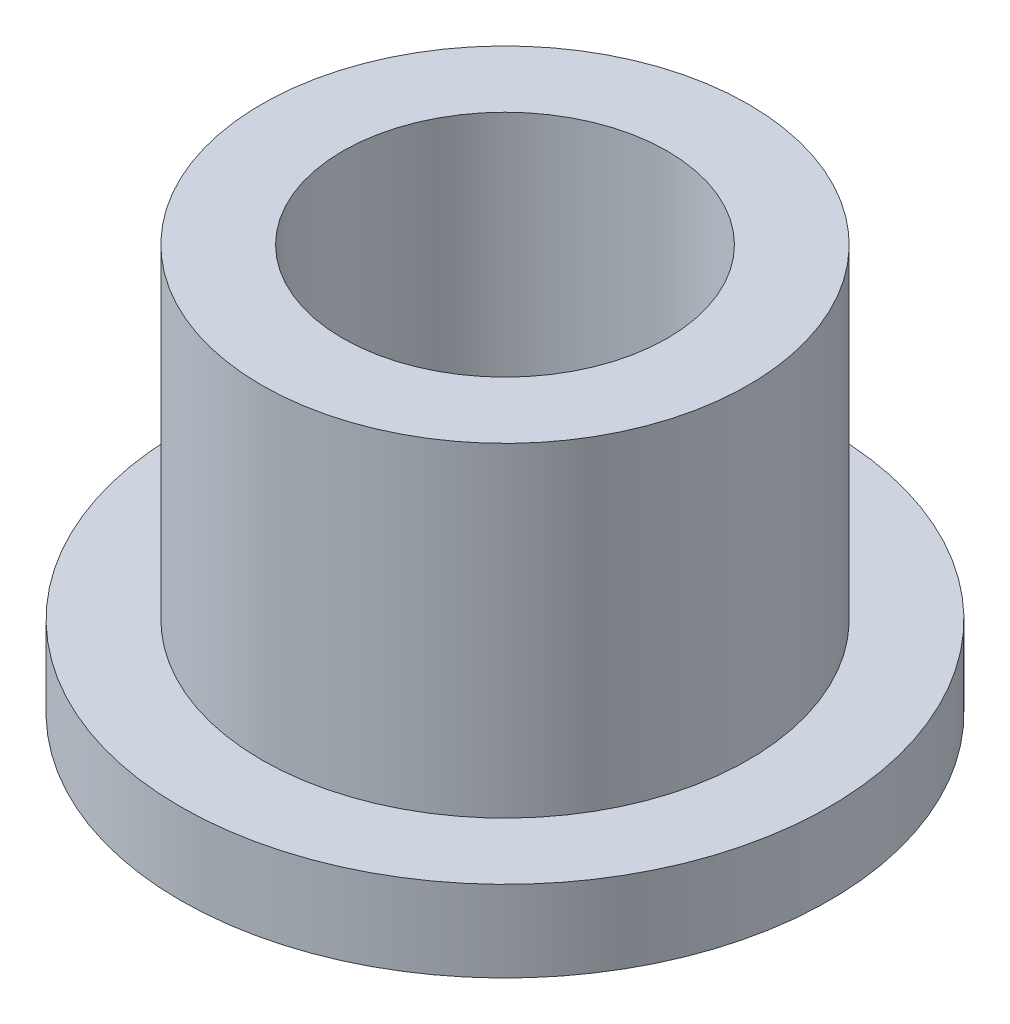
ISO-10303-21;
HEADER;
FILE_DESCRIPTION(('STEP AP214'),'2;1');
FILE_NAME('part.step','',(''),(''),'','','');
FILE_SCHEMA(('AUTOMOTIVE_DESIGN { 1 0 10303 214 1 1 1 1 }'));
ENDSEC;
DATA;
#1=APPLICATION_CONTEXT('core data for automotive mechanical design processes');
#2=APPLICATION_PROTOCOL_DEFINITION('international standard','automotive_design',2000,#1);
#3=PRODUCT_CONTEXT('',#1,'mechanical');
#4=PRODUCT('Part','Part','',(#3));
#5=PRODUCT_RELATED_PRODUCT_CATEGORY('part','',(#4));
#6=PRODUCT_DEFINITION_FORMATION('','',#4);
#7=PRODUCT_DEFINITION_CONTEXT('part definition',#1,'design');
#8=PRODUCT_DEFINITION('design','',#6,#7);
#9=PRODUCT_DEFINITION_SHAPE('','',#8);
#10=(LENGTH_UNIT() NAMED_UNIT(*) SI_UNIT(.MILLI.,.METRE.));
#11=(NAMED_UNIT(*) PLANE_ANGLE_UNIT() SI_UNIT($,.RADIAN.));
#12=(NAMED_UNIT(*) SI_UNIT($,.STERADIAN.) SOLID_ANGLE_UNIT());
#13=UNCERTAINTY_MEASURE_WITH_UNIT(LENGTH_MEASURE(1.E-05),#10,'distance_accuracy_value','');
#14=(GEOMETRIC_REPRESENTATION_CONTEXT(3) GLOBAL_UNCERTAINTY_ASSIGNED_CONTEXT((#13)) GLOBAL_UNIT_ASSIGNED_CONTEXT((#10,
#11,#12)) REPRESENTATION_CONTEXT('',''));
#15=CARTESIAN_POINT('',(0.,0.,0.));
#16=DIRECTION('',(0.,0.,1.));
#17=DIRECTION('',(1.,0.,0.));
#18=AXIS2_PLACEMENT_3D('',#15,#16,#17);
#19=CARTESIAN_POINT('',(0.,7.9375,0.));
#20=DIRECTION('',(0.,1.,0.));
#21=DIRECTION('',(0.,0.,1.));
#22=AXIS2_PLACEMENT_3D('',#19,#20,#21);
#23=PLANE('',#22);
#24=CARTESIAN_POINT('',(0.,7.9375,0.));
#25=DIRECTION('',(0.,1.,0.));
#26=DIRECTION('',(0.,0.,1.));
#27=AXIS2_PLACEMENT_3D('',#24,#25,#26);
#28=CIRCLE('',#27,4.7625);
#29=CARTESIAN_POINT('',(0.,7.9375,4.7625));
#30=VERTEX_POINT('',#29);
#31=EDGE_CURVE('E10',#30,#30,#28,.T.);
#32=ORIENTED_EDGE('',*,*,#31,.T.);
#33=EDGE_LOOP('',(#32));
#34=FACE_BOUND('',#33,.T.);
#35=CARTESIAN_POINT('',(0.,7.9375,0.));
#36=DIRECTION('',(0.,1.,0.));
#37=DIRECTION('',(0.,0.,1.));
#38=AXIS2_PLACEMENT_3D('',#35,#36,#37);
#39=CIRCLE('',#38,3.175);
#40=CARTESIAN_POINT('',(0.,7.9375,3.175));
#41=VERTEX_POINT('',#40);
#42=EDGE_CURVE('E39',#41,#41,#39,.T.);
#43=ORIENTED_EDGE('',*,*,#42,.F.);
#44=EDGE_LOOP('',(#43));
#45=FACE_BOUND('',#44,.T.);
#46=ADVANCED_FACE('F32',(#34,#45),#23,.T.);
#47=CARTESIAN_POINT('',(0.,0.,0.));
#48=DIRECTION('',(0.,1.,0.));
#49=DIRECTION('',(0.,0.,1.));
#50=AXIS2_PLACEMENT_3D('',#47,#48,#49);
#51=PLANE('',#50);
#52=CARTESIAN_POINT('',(0.,0.,0.));
#53=DIRECTION('',(0.,1.,0.));
#54=DIRECTION('',(0.,0.,1.));
#55=AXIS2_PLACEMENT_3D('',#52,#53,#54);
#56=CIRCLE('',#55,3.175);
#57=CARTESIAN_POINT('',(0.,0.,3.175));
#58=VERTEX_POINT('',#57);
#59=EDGE_CURVE('E43',#58,#58,#56,.T.);
#60=ORIENTED_EDGE('',*,*,#59,.T.);
#61=EDGE_LOOP('',(#60));
#62=FACE_BOUND('',#61,.T.);
#63=CARTESIAN_POINT('',(0.,0.,0.));
#64=DIRECTION('',(0.,1.,0.));
#65=DIRECTION('',(0.,0.,1.));
#66=AXIS2_PLACEMENT_3D('',#63,#64,#65);
#67=CIRCLE('',#66,6.35);
#68=CARTESIAN_POINT('',(0.,0.,6.35));
#69=VERTEX_POINT('',#68);
#70=EDGE_CURVE('E50',#69,#69,#67,.T.);
#71=ORIENTED_EDGE('',*,*,#70,.F.);
#72=EDGE_LOOP('',(#71));
#73=FACE_BOUND('',#72,.T.);
#74=ADVANCED_FACE('F75',(#62,#73),#51,.F.);
#75=CARTESIAN_POINT('',(0.,7.9375,0.));
#76=DIRECTION('',(0.,-1.,0.));
#77=DIRECTION('',(0.,0.,-1.));
#78=AXIS2_PLACEMENT_3D('',#75,#76,#77);
#79=CYLINDRICAL_SURFACE('',#78,4.7625);
#80=CARTESIAN_POINT('',(0.,1.5875,0.));
#81=DIRECTION('',(0.,1.,0.));
#82=DIRECTION('',(0.,0.,1.));
#83=AXIS2_PLACEMENT_3D('',#80,#81,#82);
#84=CIRCLE('',#83,4.7625);
#85=CARTESIAN_POINT('',(0.,1.5875,4.7625));
#86=VERTEX_POINT('',#85);
#87=EDGE_CURVE('E53',#86,#86,#84,.T.);
#88=ORIENTED_EDGE('',*,*,#87,.T.);
#89=EDGE_LOOP('',(#88));
#90=FACE_BOUND('',#89,.T.);
#91=ORIENTED_EDGE('',*,*,#31,.F.);
#92=EDGE_LOOP('',(#91));
#93=FACE_BOUND('',#92,.T.);
#94=ADVANCED_FACE('F34',(#90,#93),#79,.T.);
#95=CARTESIAN_POINT('',(0.,7.9375,0.));
#96=DIRECTION('',(0.,-1.,0.));
#97=DIRECTION('',(0.,0.,-1.));
#98=AXIS2_PLACEMENT_3D('',#95,#96,#97);
#99=CYLINDRICAL_SURFACE('',#98,3.175);
#100=ORIENTED_EDGE('',*,*,#42,.T.);
#101=EDGE_LOOP('',(#100));
#102=FACE_BOUND('',#101,.T.);
#103=ORIENTED_EDGE('',*,*,#59,.F.);
#104=EDGE_LOOP('',(#103));
#105=FACE_BOUND('',#104,.T.);
#106=ADVANCED_FACE('F64',(#102,#105),#99,.F.);
#107=CARTESIAN_POINT('',(0.,1.5875,0.));
#108=DIRECTION('',(0.,1.,0.));
#109=DIRECTION('',(0.,0.,1.));
#110=AXIS2_PLACEMENT_3D('',#107,#108,#109);
#111=PLANE('',#110);
#112=CARTESIAN_POINT('',(0.,1.5875,0.));
#113=DIRECTION('',(0.,1.,0.));
#114=DIRECTION('',(0.,0.,1.));
#115=AXIS2_PLACEMENT_3D('',#112,#113,#114);
#116=CIRCLE('',#115,6.35);
#117=CARTESIAN_POINT('',(0.,1.5875,6.35));
#118=VERTEX_POINT('',#117);
#119=EDGE_CURVE('E48',#118,#118,#116,.T.);
#120=ORIENTED_EDGE('',*,*,#119,.T.);
#121=EDGE_LOOP('',(#120));
#122=FACE_BOUND('',#121,.T.);
#123=ORIENTED_EDGE('',*,*,#87,.F.);
#124=EDGE_LOOP('',(#123));
#125=FACE_BOUND('',#124,.T.);
#126=ADVANCED_FACE('F61',(#122,#125),#111,.T.);
#127=CARTESIAN_POINT('',(0.,1.5875,0.));
#128=DIRECTION('',(0.,-1.,0.));
#129=DIRECTION('',(0.,0.,-1.));
#130=AXIS2_PLACEMENT_3D('',#127,#128,#129);
#131=CYLINDRICAL_SURFACE('',#130,6.35);
#132=ORIENTED_EDGE('',*,*,#119,.F.);
#133=EDGE_LOOP('',(#132));
#134=FACE_BOUND('',#133,.T.);
#135=ORIENTED_EDGE('',*,*,#70,.T.);
#136=EDGE_LOOP('',(#135));
#137=FACE_BOUND('',#136,.T.);
#138=ADVANCED_FACE('F63',(#134,#137),#131,.T.);
#139=CLOSED_SHELL('',(#46,#74,#94,#106,#126,#138));
#140=MANIFOLD_SOLID_BREP('B2',#139);
#141=ADVANCED_BREP_SHAPE_REPRESENTATION('',(#18,#140),#14);
#142=SHAPE_DEFINITION_REPRESENTATION(#9,#141);
ENDSEC;
END-ISO-10303-21;
